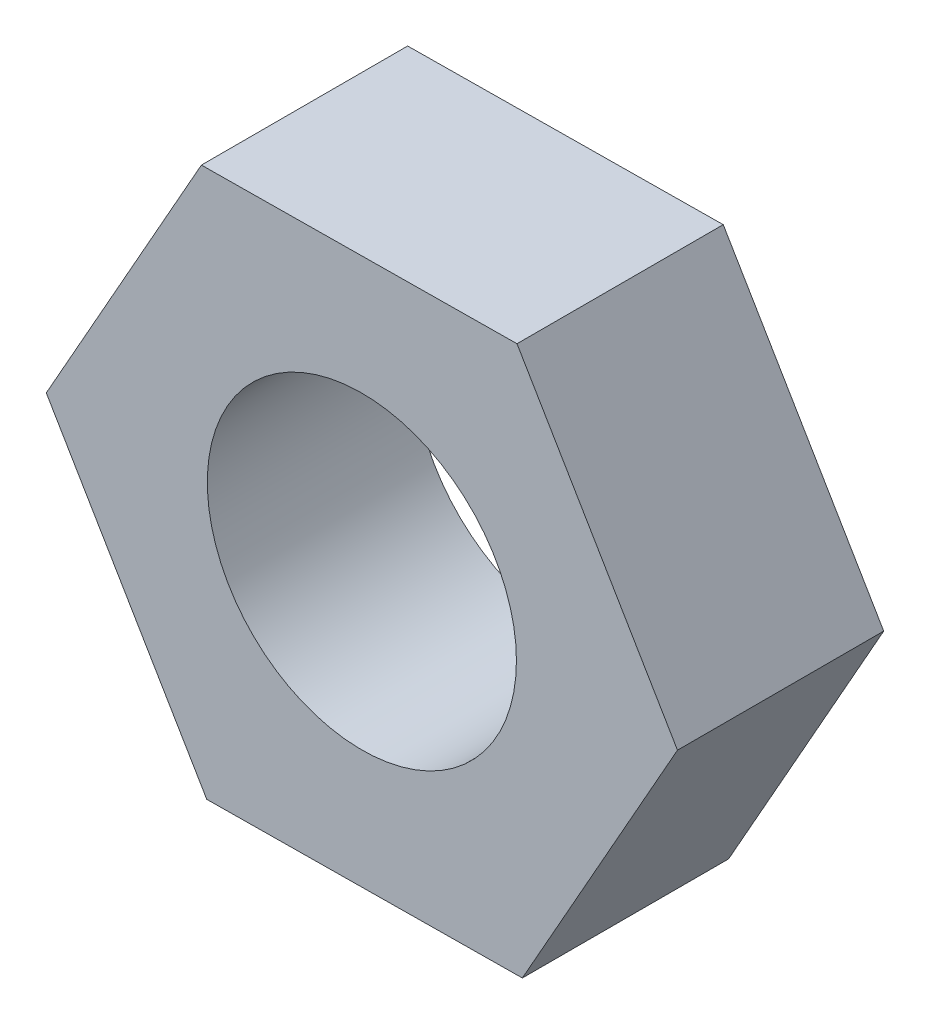
ISO-10303-21;
HEADER;
FILE_DESCRIPTION(('STEP AP214'),'2;1');
FILE_NAME('part.step','',(''),(''),'','','');
FILE_SCHEMA(('AUTOMOTIVE_DESIGN { 1 0 10303 214 1 1 1 1 }'));
ENDSEC;
DATA;
#1=APPLICATION_CONTEXT('core data for automotive mechanical design processes');
#2=APPLICATION_PROTOCOL_DEFINITION('international standard','automotive_design',2000,#1);
#3=PRODUCT_CONTEXT('',#1,'mechanical');
#4=PRODUCT('Part','Part','',(#3));
#5=PRODUCT_RELATED_PRODUCT_CATEGORY('part','',(#4));
#6=PRODUCT_DEFINITION_FORMATION('','',#4);
#7=PRODUCT_DEFINITION_CONTEXT('part definition',#1,'design');
#8=PRODUCT_DEFINITION('design','',#6,#7);
#9=PRODUCT_DEFINITION_SHAPE('','',#8);
#10=(LENGTH_UNIT() NAMED_UNIT(*) SI_UNIT(.MILLI.,.METRE.));
#11=(NAMED_UNIT(*) PLANE_ANGLE_UNIT() SI_UNIT($,.RADIAN.));
#12=(NAMED_UNIT(*) SI_UNIT($,.STERADIAN.) SOLID_ANGLE_UNIT());
#13=UNCERTAINTY_MEASURE_WITH_UNIT(LENGTH_MEASURE(1.E-05),#10,'distance_accuracy_value','');
#14=(GEOMETRIC_REPRESENTATION_CONTEXT(3) GLOBAL_UNCERTAINTY_ASSIGNED_CONTEXT((#13)) GLOBAL_UNIT_ASSIGNED_CONTEXT((#10,
#11,#12)) REPRESENTATION_CONTEXT('',''));
#15=CARTESIAN_POINT('',(0.,0.,0.));
#16=DIRECTION('',(0.,0.,1.));
#17=DIRECTION('',(1.,0.,0.));
#18=AXIS2_PLACEMENT_3D('',#15,#16,#17);
#19=CARTESIAN_POINT('',(3.12146200402984,5.5308053925926,4.15));
#20=DIRECTION('',(0.00978408793894536,-0.999952134666056,0.));
#21=DIRECTION('',(0.999952134666056,0.00978408793894536,0.));
#22=AXIS2_PLACEMENT_3D('',#19,#20,#21);
#23=PLANE('',#22);
#24=DIRECTION('',(-0.999952134666056,-0.00978408793894536,0.));
#25=VECTOR('',#24,1.);
#26=CARTESIAN_POINT('',(3.12146200402984,5.5308053925926,0.));
#27=LINE('',#26,#25);
#28=CARTESIAN_POINT('',(3.12146200402984,5.5308053925926,0.));
#29=VERTEX_POINT('',#28);
#30=CARTESIAN_POINT('',(-3.22908697135823,5.46866808873402,0.));
#31=VERTEX_POINT('',#30);
#32=EDGE_CURVE('E116',#29,#31,#27,.T.);
#33=ORIENTED_EDGE('',*,*,#32,.T.);
#34=DIRECTION('',(0.,0.,-1.));
#35=VECTOR('',#34,1.);
#36=CARTESIAN_POINT('',(-3.22908697135823,5.46866808873402,4.15));
#37=LINE('',#36,#35);
#38=CARTESIAN_POINT('',(-3.22908697135823,5.46866808873402,4.15));
#39=VERTEX_POINT('',#38);
#40=EDGE_CURVE('E11',#39,#31,#37,.T.);
#41=ORIENTED_EDGE('',*,*,#40,.F.);
#42=DIRECTION('',(-0.999952134666056,-0.00978408793894536,0.));
#43=VECTOR('',#42,1.);
#44=CARTESIAN_POINT('',(3.12146200402984,5.5308053925926,4.15));
#45=LINE('',#44,#43);
#46=CARTESIAN_POINT('',(3.12146200402984,5.5308053925926,4.15));
#47=VERTEX_POINT('',#46);
#48=EDGE_CURVE('E127',#47,#39,#45,.T.);
#49=ORIENTED_EDGE('',*,*,#48,.F.);
#50=DIRECTION('',(0.,0.,-1.));
#51=VECTOR('',#50,1.);
#52=CARTESIAN_POINT('',(3.12146200402984,5.5308053925926,4.15));
#53=LINE('',#52,#51);
#54=EDGE_CURVE('E112',#47,#29,#53,.T.);
#55=ORIENTED_EDGE('',*,*,#54,.T.);
#56=EDGE_LOOP('',(#33,#41,#49,#55));
#57=FACE_BOUND('',#56,.T.);
#58=ADVANCED_FACE('F32',(#57),#23,.F.);
#59=CARTESIAN_POINT('',(-3.22908697135823,5.46866808873402,4.15));
#60=DIRECTION('',(0.870875995158756,-0.49150279862504,0.));
#61=DIRECTION('',(0.49150279862504,0.870875995158756,0.));
#62=AXIS2_PLACEMENT_3D('',#59,#60,#61);
#63=PLANE('',#62);
#64=DIRECTION('',(-0.49150279862504,-0.870875995158756,0.));
#65=VECTOR('',#64,1.);
#66=CARTESIAN_POINT('',(-3.22908697135823,5.46866808873402,0.));
#67=LINE('',#66,#65);
#68=CARTESIAN_POINT('',(-6.35054897538807,-0.0621373038585775,0.));
#69=VERTEX_POINT('',#68);
#70=EDGE_CURVE('E119',#31,#69,#67,.T.);
#71=ORIENTED_EDGE('',*,*,#70,.T.);
#72=DIRECTION('',(0.,0.,-1.));
#73=VECTOR('',#72,1.);
#74=CARTESIAN_POINT('',(-6.35054897538807,-0.0621373038585775,4.15));
#75=LINE('',#74,#73);
#76=CARTESIAN_POINT('',(-6.35054897538807,-0.0621373038585775,4.15));
#77=VERTEX_POINT('',#76);
#78=EDGE_CURVE('E40',#77,#69,#75,.T.);
#79=ORIENTED_EDGE('',*,*,#78,.F.);
#80=DIRECTION('',(-0.49150279862504,-0.870875995158756,0.));
#81=VECTOR('',#80,1.);
#82=CARTESIAN_POINT('',(-3.22908697135823,5.46866808873402,4.15));
#83=LINE('',#82,#81);
#84=EDGE_CURVE('E85',#39,#77,#83,.T.);
#85=ORIENTED_EDGE('',*,*,#84,.F.);
#86=ORIENTED_EDGE('',*,*,#40,.T.);
#87=EDGE_LOOP('',(#71,#79,#85,#86));
#88=FACE_BOUND('',#87,.T.);
#89=ADVANCED_FACE('F152',(#88),#63,.F.);
#90=CARTESIAN_POINT('',(-6.35054897538807,-0.0621373038585775,4.15));
#91=DIRECTION('',(0.86109190721981,0.508449336041016,0.));
#92=DIRECTION('',(-0.508449336041016,0.86109190721981,0.));
#93=AXIS2_PLACEMENT_3D('',#90,#91,#92);
#94=PLANE('',#93);
#95=DIRECTION('',(0.508449336041016,-0.86109190721981,0.));
#96=VECTOR('',#95,1.);
#97=CARTESIAN_POINT('',(-6.35054897538807,-0.0621373038585775,0.));
#98=LINE('',#97,#96);
#99=CARTESIAN_POINT('',(-3.12146200402983,-5.5308053925926,0.));
#100=VERTEX_POINT('',#99);
#101=EDGE_CURVE('E122',#69,#100,#98,.T.);
#102=ORIENTED_EDGE('',*,*,#101,.T.);
#103=DIRECTION('',(0.,0.,-1.));
#104=VECTOR('',#103,1.);
#105=CARTESIAN_POINT('',(-3.12146200402983,-5.5308053925926,4.15));
#106=LINE('',#105,#104);
#107=CARTESIAN_POINT('',(-3.12146200402983,-5.5308053925926,4.15));
#108=VERTEX_POINT('',#107);
#109=EDGE_CURVE('E107',#108,#100,#106,.T.);
#110=ORIENTED_EDGE('',*,*,#109,.F.);
#111=DIRECTION('',(0.508449336041016,-0.86109190721981,0.));
#112=VECTOR('',#111,1.);
#113=CARTESIAN_POINT('',(-6.35054897538807,-0.0621373038585775,4.15));
#114=LINE('',#113,#112);
#115=EDGE_CURVE('E98',#77,#108,#114,.T.);
#116=ORIENTED_EDGE('',*,*,#115,.F.);
#117=ORIENTED_EDGE('',*,*,#78,.T.);
#118=EDGE_LOOP('',(#102,#110,#116,#117));
#119=FACE_BOUND('',#118,.T.);
#120=ADVANCED_FACE('F133',(#119),#94,.F.);
#121=CARTESIAN_POINT('',(-3.12146200402983,-5.5308053925926,4.15));
#122=DIRECTION('',(-0.00978408793894536,0.999952134666056,0.));
#123=DIRECTION('',(-0.999952134666056,-0.00978408793894536,0.));
#124=AXIS2_PLACEMENT_3D('',#121,#122,#123);
#125=PLANE('',#124);
#126=DIRECTION('',(0.999952134666056,0.00978408793894536,0.));
#127=VECTOR('',#126,1.);
#128=CARTESIAN_POINT('',(-3.12146200402983,-5.5308053925926,0.));
#129=LINE('',#128,#127);
#130=CARTESIAN_POINT('',(3.22908697135824,-5.46866808873402,0.));
#131=VERTEX_POINT('',#130);
#132=EDGE_CURVE('E106',#100,#131,#129,.T.);
#133=ORIENTED_EDGE('',*,*,#132,.T.);
#134=DIRECTION('',(0.,0.,-1.));
#135=VECTOR('',#134,1.);
#136=CARTESIAN_POINT('',(3.22908697135824,-5.46866808873402,4.15));
#137=LINE('',#136,#135);
#138=CARTESIAN_POINT('',(3.22908697135824,-5.46866808873402,4.15));
#139=VERTEX_POINT('',#138);
#140=EDGE_CURVE('E103',#139,#131,#137,.T.);
#141=ORIENTED_EDGE('',*,*,#140,.F.);
#142=DIRECTION('',(0.999952134666056,0.00978408793894536,0.));
#143=VECTOR('',#142,1.);
#144=CARTESIAN_POINT('',(-3.12146200402983,-5.5308053925926,4.15));
#145=LINE('',#144,#143);
#146=EDGE_CURVE('E92',#108,#139,#145,.T.);
#147=ORIENTED_EDGE('',*,*,#146,.F.);
#148=ORIENTED_EDGE('',*,*,#109,.T.);
#149=EDGE_LOOP('',(#133,#141,#147,#148));
#150=FACE_BOUND('',#149,.T.);
#151=ADVANCED_FACE('F104',(#150),#125,.F.);
#152=CARTESIAN_POINT('',(3.22908697135824,-5.46866808873402,4.15));
#153=DIRECTION('',(-0.870875995158756,0.49150279862504,0.));
#154=DIRECTION('',(-0.491502798625041,-0.870875995158756,0.));
#155=AXIS2_PLACEMENT_3D('',#152,#153,#154);
#156=PLANE('',#155);
#157=DIRECTION('',(0.49150279862504,0.870875995158756,0.));
#158=VECTOR('',#157,1.);
#159=CARTESIAN_POINT('',(3.22908697135824,-5.46866808873402,0.));
#160=LINE('',#159,#158);
#161=CARTESIAN_POINT('',(6.35054897538807,0.0621373038585754,0.));
#162=VERTEX_POINT('',#161);
#163=EDGE_CURVE('E71',#131,#162,#160,.T.);
#164=ORIENTED_EDGE('',*,*,#163,.T.);
#165=DIRECTION('',(0.,0.,-1.));
#166=VECTOR('',#165,1.);
#167=CARTESIAN_POINT('',(6.35054897538807,0.0621373038585754,4.15));
#168=LINE('',#167,#166);
#169=CARTESIAN_POINT('',(6.35054897538807,0.0621373038585754,4.15));
#170=VERTEX_POINT('',#169);
#171=EDGE_CURVE('E108',#170,#162,#168,.T.);
#172=ORIENTED_EDGE('',*,*,#171,.F.);
#173=DIRECTION('',(0.49150279862504,0.870875995158756,0.));
#174=VECTOR('',#173,1.);
#175=CARTESIAN_POINT('',(3.22908697135824,-5.46866808873402,4.15));
#176=LINE('',#175,#174);
#177=EDGE_CURVE('E96',#139,#170,#176,.T.);
#178=ORIENTED_EDGE('',*,*,#177,.F.);
#179=ORIENTED_EDGE('',*,*,#140,.T.);
#180=EDGE_LOOP('',(#164,#172,#178,#179));
#181=FACE_BOUND('',#180,.T.);
#182=ADVANCED_FACE('F110',(#181),#156,.F.);
#183=CARTESIAN_POINT('',(6.35054897538807,0.0621373038585754,4.15));
#184=DIRECTION('',(-0.86109190721981,-0.508449336041016,0.));
#185=DIRECTION('',(0.508449336041016,-0.86109190721981,0.));
#186=AXIS2_PLACEMENT_3D('',#183,#184,#185);
#187=PLANE('',#186);
#188=DIRECTION('',(-0.508449336041016,0.86109190721981,0.));
#189=VECTOR('',#188,1.);
#190=CARTESIAN_POINT('',(6.35054897538807,0.0621373038585754,0.));
#191=LINE('',#190,#189);
#192=EDGE_CURVE('E77',#162,#29,#191,.T.);
#193=ORIENTED_EDGE('',*,*,#192,.T.);
#194=ORIENTED_EDGE('',*,*,#54,.F.);
#195=DIRECTION('',(-0.508449336041016,0.86109190721981,0.));
#196=VECTOR('',#195,1.);
#197=CARTESIAN_POINT('',(6.35054897538807,0.0621373038585754,4.15));
#198=LINE('',#197,#196);
#199=EDGE_CURVE('E48',#170,#47,#198,.T.);
#200=ORIENTED_EDGE('',*,*,#199,.F.);
#201=ORIENTED_EDGE('',*,*,#171,.T.);
#202=EDGE_LOOP('',(#193,#194,#200,#201));
#203=FACE_BOUND('',#202,.T.);
#204=ADVANCED_FACE('F140',(#203),#187,.F.);
#205=CARTESIAN_POINT('',(0.,0.,4.15));
#206=DIRECTION('',(0.,0.,1.));
#207=DIRECTION('',(1.,0.,0.));
#208=AXIS2_PLACEMENT_3D('',#205,#206,#207);
#209=PLANE('',#208);
#210=CARTESIAN_POINT('',(0.,0.,4.15));
#211=DIRECTION('',(0.,0.,1.));
#212=DIRECTION('',(1.,0.,0.));
#213=AXIS2_PLACEMENT_3D('',#210,#211,#212);
#214=CIRCLE('',#213,3.11);
#215=CARTESIAN_POINT('',(3.11,0.,4.15));
#216=VERTEX_POINT('',#215);
#217=EDGE_CURVE('E207',#216,#216,#214,.T.);
#218=ORIENTED_EDGE('',*,*,#217,.F.);
#219=EDGE_LOOP('',(#218));
#220=FACE_BOUND('',#219,.T.);
#221=ORIENTED_EDGE('',*,*,#48,.T.);
#222=ORIENTED_EDGE('',*,*,#84,.T.);
#223=ORIENTED_EDGE('',*,*,#115,.T.);
#224=ORIENTED_EDGE('',*,*,#146,.T.);
#225=ORIENTED_EDGE('',*,*,#177,.T.);
#226=ORIENTED_EDGE('',*,*,#199,.T.);
#227=EDGE_LOOP('',(#221,#222,#223,#224,#225,#226));
#228=FACE_BOUND('',#227,.T.);
#229=ADVANCED_FACE('F94',(#220,#228),#209,.T.);
#230=CARTESIAN_POINT('',(0.,0.,0.));
#231=DIRECTION('',(0.,0.,1.));
#232=DIRECTION('',(1.,0.,0.));
#233=AXIS2_PLACEMENT_3D('',#230,#231,#232);
#234=PLANE('',#233);
#235=CARTESIAN_POINT('',(0.,0.,0.));
#236=DIRECTION('',(0.,0.,1.));
#237=DIRECTION('',(1.,0.,0.));
#238=AXIS2_PLACEMENT_3D('',#235,#236,#237);
#239=CIRCLE('',#238,3.11);
#240=CARTESIAN_POINT('',(3.11,0.,0.));
#241=VERTEX_POINT('',#240);
#242=EDGE_CURVE('E120',#241,#241,#239,.T.);
#243=ORIENTED_EDGE('',*,*,#242,.T.);
#244=EDGE_LOOP('',(#243));
#245=FACE_BOUND('',#244,.T.);
#246=ORIENTED_EDGE('',*,*,#32,.F.);
#247=ORIENTED_EDGE('',*,*,#192,.F.);
#248=ORIENTED_EDGE('',*,*,#163,.F.);
#249=ORIENTED_EDGE('',*,*,#132,.F.);
#250=ORIENTED_EDGE('',*,*,#101,.F.);
#251=ORIENTED_EDGE('',*,*,#70,.F.);
#252=EDGE_LOOP('',(#246,#247,#248,#249,#250,#251));
#253=FACE_BOUND('',#252,.T.);
#254=ADVANCED_FACE('F136',(#245,#253),#234,.F.);
#255=CARTESIAN_POINT('',(0.,0.,0.));
#256=DIRECTION('',(0.,0.,1.));
#257=DIRECTION('',(1.,0.,0.));
#258=AXIS2_PLACEMENT_3D('',#255,#256,#257);
#259=CYLINDRICAL_SURFACE('',#258,3.11);
#260=ORIENTED_EDGE('',*,*,#242,.F.);
#261=EDGE_LOOP('',(#260));
#262=FACE_BOUND('',#261,.T.);
#263=ORIENTED_EDGE('',*,*,#217,.T.);
#264=EDGE_LOOP('',(#263));
#265=FACE_BOUND('',#264,.T.);
#266=ADVANCED_FACE('F189',(#262,#265),#259,.F.);
#267=CLOSED_SHELL('',(#58,#89,#120,#151,#182,#204,#229,#254,#266));
#268=MANIFOLD_SOLID_BREP('B2',#267);
#269=ADVANCED_BREP_SHAPE_REPRESENTATION('',(#18,#268),#14);
#270=SHAPE_DEFINITION_REPRESENTATION(#9,#269);
ENDSEC;
END-ISO-10303-21;
